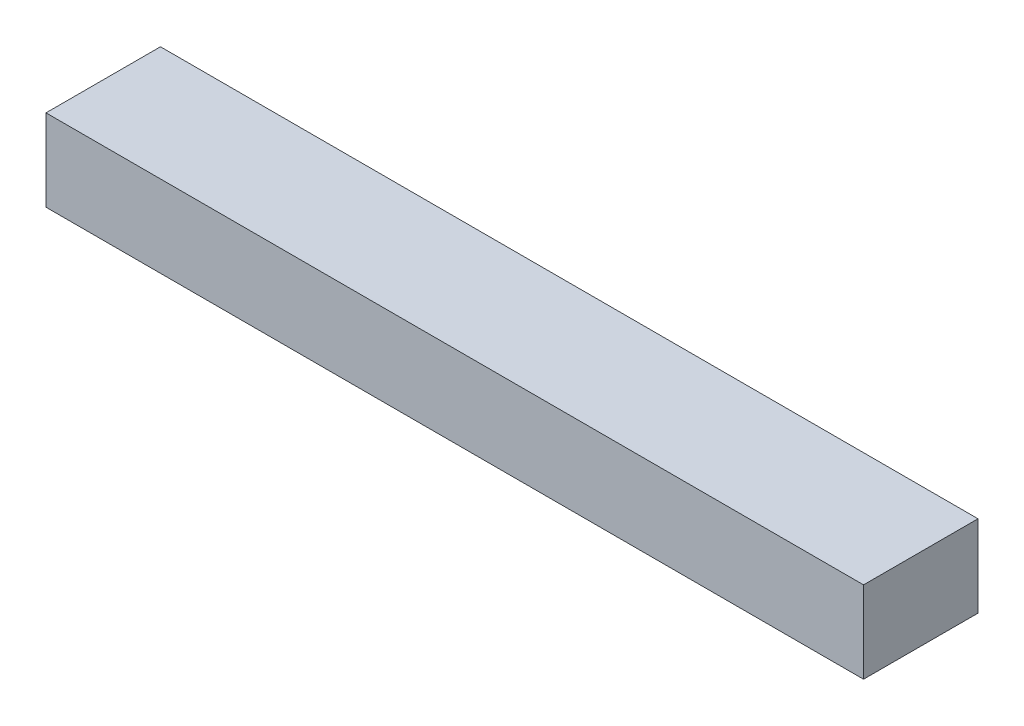
ISO-10303-21;
HEADER;
FILE_DESCRIPTION(('STEP AP214'),'2;1');
FILE_NAME('part.step','',(''),(''),'','','');
FILE_SCHEMA(('AUTOMOTIVE_DESIGN { 1 0 10303 214 1 1 1 1 }'));
ENDSEC;
DATA;
#1=APPLICATION_CONTEXT('core data for automotive mechanical design processes');
#2=APPLICATION_PROTOCOL_DEFINITION('international standard','automotive_design',2000,#1);
#3=PRODUCT_CONTEXT('',#1,'mechanical');
#4=PRODUCT('Part','Part','',(#3));
#5=PRODUCT_RELATED_PRODUCT_CATEGORY('part','',(#4));
#6=PRODUCT_DEFINITION_FORMATION('','',#4);
#7=PRODUCT_DEFINITION_CONTEXT('part definition',#1,'design');
#8=PRODUCT_DEFINITION('design','',#6,#7);
#9=PRODUCT_DEFINITION_SHAPE('','',#8);
#10=(LENGTH_UNIT() NAMED_UNIT(*) SI_UNIT(.MILLI.,.METRE.));
#11=(NAMED_UNIT(*) PLANE_ANGLE_UNIT() SI_UNIT($,.RADIAN.));
#12=(NAMED_UNIT(*) SI_UNIT($,.STERADIAN.) SOLID_ANGLE_UNIT());
#13=UNCERTAINTY_MEASURE_WITH_UNIT(LENGTH_MEASURE(1.E-05),#10,'distance_accuracy_value','');
#14=(GEOMETRIC_REPRESENTATION_CONTEXT(3) GLOBAL_UNCERTAINTY_ASSIGNED_CONTEXT((#13)) GLOBAL_UNIT_ASSIGNED_CONTEXT((#10,
#11,#12)) REPRESENTATION_CONTEXT('',''));
#15=CARTESIAN_POINT('',(0.,0.,0.));
#16=DIRECTION('',(0.,0.,1.));
#17=DIRECTION('',(1.,0.,0.));
#18=AXIS2_PLACEMENT_3D('',#15,#16,#17);
#19=CARTESIAN_POINT('',(5.,0.5,2.));
#20=DIRECTION('',(-1.,0.,0.));
#21=DIRECTION('',(0.,0.,1.));
#22=AXIS2_PLACEMENT_3D('',#19,#20,#21);
#23=PLANE('',#22);
#24=DIRECTION('',(0.,1.,0.));
#25=VECTOR('',#24,1.);
#26=CARTESIAN_POINT('',(5.,0.5,0.3));
#27=LINE('',#26,#25);
#28=CARTESIAN_POINT('',(5.,-0.5,0.3));
#29=VERTEX_POINT('',#28);
#30=CARTESIAN_POINT('',(5.,0.5,0.3));
#31=VERTEX_POINT('',#30);
#32=EDGE_CURVE('E89',#29,#31,#27,.T.);
#33=ORIENTED_EDGE('',*,*,#32,.T.);
#34=DIRECTION('',(0.,0.,-1.));
#35=VECTOR('',#34,1.);
#36=CARTESIAN_POINT('',(5.,0.5,2.));
#37=LINE('',#36,#35);
#38=CARTESIAN_POINT('',(5.,0.5,1.7));
#39=VERTEX_POINT('',#38);
#40=EDGE_CURVE('E12',#39,#31,#37,.T.);
#41=ORIENTED_EDGE('',*,*,#40,.F.);
#42=DIRECTION('',(0.,1.,0.));
#43=VECTOR('',#42,1.);
#44=CARTESIAN_POINT('',(5.,0.5,1.7));
#45=LINE('',#44,#43);
#46=CARTESIAN_POINT('',(5.,-0.5,1.7));
#47=VERTEX_POINT('',#46);
#48=EDGE_CURVE('E101',#47,#39,#45,.T.);
#49=ORIENTED_EDGE('',*,*,#48,.F.);
#50=DIRECTION('',(0.,0.,-1.));
#51=VECTOR('',#50,1.);
#52=CARTESIAN_POINT('',(5.,-0.5,2.));
#53=LINE('',#52,#51);
#54=EDGE_CURVE('E95',#47,#29,#53,.T.);
#55=ORIENTED_EDGE('',*,*,#54,.T.);
#56=EDGE_LOOP('',(#33,#41,#49,#55));
#57=FACE_BOUND('',#56,.T.);
#58=ADVANCED_FACE('F35',(#57),#23,.F.);
#59=CARTESIAN_POINT('',(-5.,0.5,2.));
#60=DIRECTION('',(0.,-1.,0.));
#61=DIRECTION('',(0.,0.,-1.));
#62=AXIS2_PLACEMENT_3D('',#59,#60,#61);
#63=PLANE('',#62);
#64=DIRECTION('',(-1.,0.,0.));
#65=VECTOR('',#64,1.);
#66=CARTESIAN_POINT('',(-5.,0.5,0.3));
#67=LINE('',#66,#65);
#68=CARTESIAN_POINT('',(-5.,0.5,0.3));
#69=VERTEX_POINT('',#68);
#70=EDGE_CURVE('E86',#31,#69,#67,.T.);
#71=ORIENTED_EDGE('',*,*,#70,.T.);
#72=DIRECTION('',(0.,0.,-1.));
#73=VECTOR('',#72,1.);
#74=CARTESIAN_POINT('',(-5.,0.5,2.));
#75=LINE('',#74,#73);
#76=CARTESIAN_POINT('',(-5.,0.5,1.7));
#77=VERTEX_POINT('',#76);
#78=EDGE_CURVE('E45',#77,#69,#75,.T.);
#79=ORIENTED_EDGE('',*,*,#78,.F.);
#80=DIRECTION('',(-1.,0.,0.));
#81=VECTOR('',#80,1.);
#82=CARTESIAN_POINT('',(-5.,0.5,1.7));
#83=LINE('',#82,#81);
#84=EDGE_CURVE('E39',#39,#77,#83,.T.);
#85=ORIENTED_EDGE('',*,*,#84,.F.);
#86=ORIENTED_EDGE('',*,*,#40,.T.);
#87=EDGE_LOOP('',(#71,#79,#85,#86));
#88=FACE_BOUND('',#87,.T.);
#89=ADVANCED_FACE('F92',(#88),#63,.F.);
#90=CARTESIAN_POINT('',(-5.,0.5,2.));
#91=DIRECTION('',(1.,0.,0.));
#92=DIRECTION('',(0.,0.,-1.));
#93=AXIS2_PLACEMENT_3D('',#90,#91,#92);
#94=PLANE('',#93);
#95=DIRECTION('',(0.,-1.,0.));
#96=VECTOR('',#95,1.);
#97=CARTESIAN_POINT('',(-5.,0.5,0.3));
#98=LINE('',#97,#96);
#99=CARTESIAN_POINT('',(-5.,-0.5,0.3));
#100=VERTEX_POINT('',#99);
#101=EDGE_CURVE('E78',#69,#100,#98,.T.);
#102=ORIENTED_EDGE('',*,*,#101,.T.);
#103=DIRECTION('',(0.,0.,-1.));
#104=VECTOR('',#103,1.);
#105=CARTESIAN_POINT('',(-5.,-0.5,2.));
#106=LINE('',#105,#104);
#107=CARTESIAN_POINT('',(-5.,-0.5,1.7));
#108=VERTEX_POINT('',#107);
#109=EDGE_CURVE('E105',#108,#100,#106,.T.);
#110=ORIENTED_EDGE('',*,*,#109,.F.);
#111=DIRECTION('',(0.,-1.,0.));
#112=VECTOR('',#111,1.);
#113=CARTESIAN_POINT('',(-5.,0.5,1.7));
#114=LINE('',#113,#112);
#115=EDGE_CURVE('E103',#77,#108,#114,.T.);
#116=ORIENTED_EDGE('',*,*,#115,.F.);
#117=ORIENTED_EDGE('',*,*,#78,.T.);
#118=EDGE_LOOP('',(#102,#110,#116,#117));
#119=FACE_BOUND('',#118,.T.);
#120=ADVANCED_FACE('F106',(#119),#94,.F.);
#121=CARTESIAN_POINT('',(-5.,-0.5,2.));
#122=DIRECTION('',(0.,1.,0.));
#123=DIRECTION('',(0.,0.,1.));
#124=AXIS2_PLACEMENT_3D('',#121,#122,#123);
#125=PLANE('',#124);
#126=DIRECTION('',(1.,0.,0.));
#127=VECTOR('',#126,1.);
#128=CARTESIAN_POINT('',(-5.,-0.5,0.3));
#129=LINE('',#128,#127);
#130=EDGE_CURVE('E70',#100,#29,#129,.T.);
#131=ORIENTED_EDGE('',*,*,#130,.T.);
#132=ORIENTED_EDGE('',*,*,#54,.F.);
#133=DIRECTION('',(1.,0.,0.));
#134=VECTOR('',#133,1.);
#135=CARTESIAN_POINT('',(-5.,-0.5,1.7));
#136=LINE('',#135,#134);
#137=EDGE_CURVE('E54',#108,#47,#136,.T.);
#138=ORIENTED_EDGE('',*,*,#137,.F.);
#139=ORIENTED_EDGE('',*,*,#109,.T.);
#140=EDGE_LOOP('',(#131,#132,#138,#139));
#141=FACE_BOUND('',#140,.T.);
#142=ADVANCED_FACE('F108',(#141),#125,.F.);
#143=CARTESIAN_POINT('',(0.,0.,1.7));
#144=DIRECTION('',(0.,0.,1.));
#145=DIRECTION('',(1.,0.,0.));
#146=AXIS2_PLACEMENT_3D('',#143,#144,#145);
#147=PLANE('',#146);
#148=ORIENTED_EDGE('',*,*,#48,.T.);
#149=ORIENTED_EDGE('',*,*,#84,.T.);
#150=ORIENTED_EDGE('',*,*,#115,.T.);
#151=ORIENTED_EDGE('',*,*,#137,.T.);
#152=EDGE_LOOP('',(#148,#149,#150,#151));
#153=FACE_BOUND('',#152,.T.);
#154=ADVANCED_FACE('F37',(#153),#147,.T.);
#155=CARTESIAN_POINT('',(0.,0.,0.3));
#156=DIRECTION('',(0.,0.,1.));
#157=DIRECTION('',(1.,0.,0.));
#158=AXIS2_PLACEMENT_3D('',#155,#156,#157);
#159=PLANE('',#158);
#160=ORIENTED_EDGE('',*,*,#32,.F.);
#161=ORIENTED_EDGE('',*,*,#130,.F.);
#162=ORIENTED_EDGE('',*,*,#101,.F.);
#163=ORIENTED_EDGE('',*,*,#70,.F.);
#164=EDGE_LOOP('',(#160,#161,#162,#163));
#165=FACE_BOUND('',#164,.T.);
#166=ADVANCED_FACE('F87',(#165),#159,.F.);
#167=CLOSED_SHELL('',(#58,#89,#120,#142,#154,#166));
#168=MANIFOLD_SOLID_BREP('B2',#167);
#169=ADVANCED_BREP_SHAPE_REPRESENTATION('',(#18,#168),#14);
#170=SHAPE_DEFINITION_REPRESENTATION(#9,#169);
ENDSEC;
END-ISO-10303-21;
